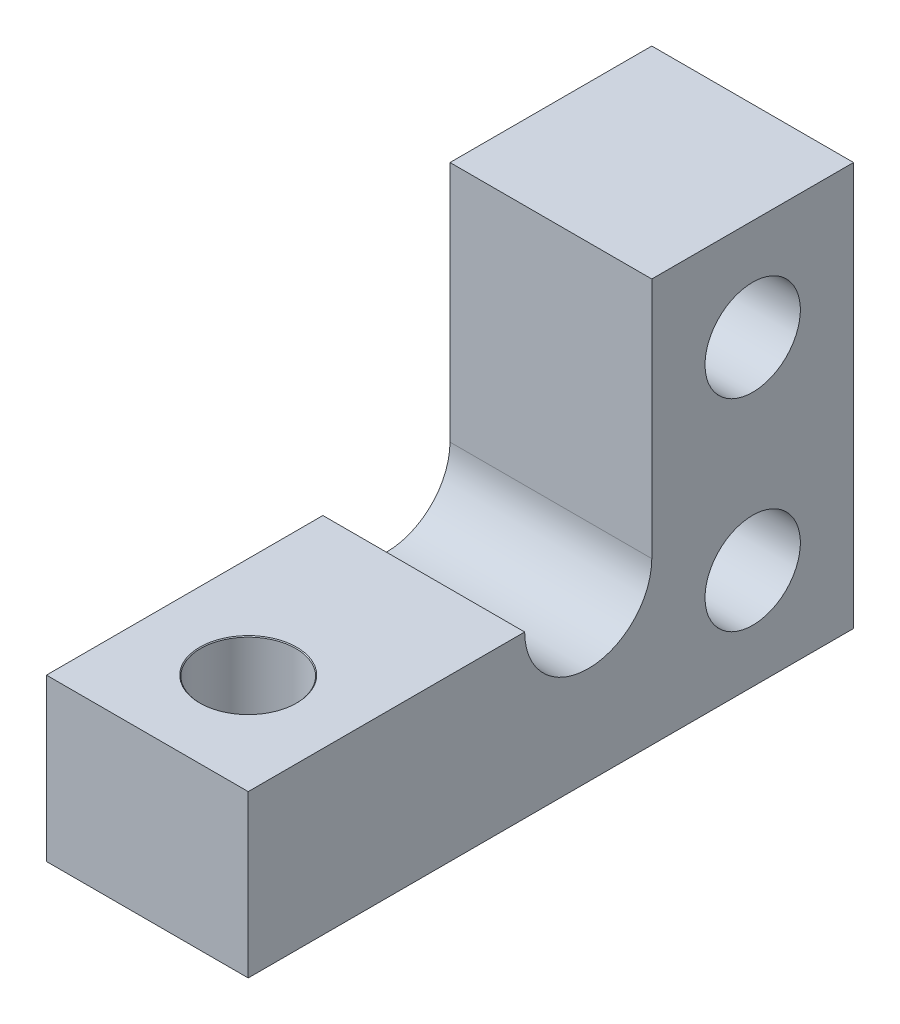
ISO-10303-21;
HEADER;
FILE_DESCRIPTION(('STEP AP214'),'2;1');
FILE_NAME('part.step','',(''),(''),'','','');
FILE_SCHEMA(('AUTOMOTIVE_DESIGN { 1 0 10303 214 1 1 1 1 }'));
ENDSEC;
DATA;
#1=APPLICATION_CONTEXT('core data for automotive mechanical design processes');
#2=APPLICATION_PROTOCOL_DEFINITION('international standard','automotive_design',2000,#1);
#3=PRODUCT_CONTEXT('',#1,'mechanical');
#4=PRODUCT('Part','Part','',(#3));
#5=PRODUCT_RELATED_PRODUCT_CATEGORY('part','',(#4));
#6=PRODUCT_DEFINITION_FORMATION('','',#4);
#7=PRODUCT_DEFINITION_CONTEXT('part definition',#1,'design');
#8=PRODUCT_DEFINITION('design','',#6,#7);
#9=PRODUCT_DEFINITION_SHAPE('','',#8);
#10=(LENGTH_UNIT() NAMED_UNIT(*) SI_UNIT(.MILLI.,.METRE.));
#11=(NAMED_UNIT(*) PLANE_ANGLE_UNIT() SI_UNIT($,.RADIAN.));
#12=(NAMED_UNIT(*) SI_UNIT($,.STERADIAN.) SOLID_ANGLE_UNIT());
#13=UNCERTAINTY_MEASURE_WITH_UNIT(LENGTH_MEASURE(1.E-05),#10,'distance_accuracy_value','');
#14=(GEOMETRIC_REPRESENTATION_CONTEXT(3) GLOBAL_UNCERTAINTY_ASSIGNED_CONTEXT((#13)) GLOBAL_UNIT_ASSIGNED_CONTEXT((#10,
#11,#12)) REPRESENTATION_CONTEXT('',''));
#15=CARTESIAN_POINT('',(0.,0.,0.));
#16=DIRECTION('',(0.,0.,1.));
#17=DIRECTION('',(1.,0.,0.));
#18=AXIS2_PLACEMENT_3D('',#15,#16,#17);
#19=CARTESIAN_POINT('',(6.35,5.08,8.35));
#20=DIRECTION('',(-1.,0.,0.));
#21=DIRECTION('',(0.,0.,1.));
#22=AXIS2_PLACEMENT_3D('',#19,#20,#21);
#23=CYLINDRICAL_SURFACE('',#22,2.);
#24=CARTESIAN_POINT('',(0.,5.08,8.35));
#25=DIRECTION('',(1.,0.,0.));
#26=DIRECTION('',(0.,0.,-1.));
#27=AXIS2_PLACEMENT_3D('',#24,#25,#26);
#28=CIRCLE('',#27,2.);
#29=CARTESIAN_POINT('',(0.,5.08,10.35));
#30=VERTEX_POINT('',#29);
#31=CARTESIAN_POINT('',(0.,5.08,6.35));
#32=VERTEX_POINT('',#31);
#33=EDGE_CURVE('E135',#30,#32,#28,.T.);
#34=ORIENTED_EDGE('',*,*,#33,.F.);
#35=DIRECTION('',(-1.,0.,0.));
#36=VECTOR('',#35,1.);
#37=CARTESIAN_POINT('',(6.35,5.08,10.35));
#38=LINE('',#37,#36);
#39=CARTESIAN_POINT('',(6.35,5.08,10.35));
#40=VERTEX_POINT('',#39);
#41=EDGE_CURVE('E11',#40,#30,#38,.T.);
#42=ORIENTED_EDGE('',*,*,#41,.F.);
#43=CARTESIAN_POINT('',(6.35,5.08,8.35));
#44=DIRECTION('',(1.,0.,0.));
#45=DIRECTION('',(0.,0.,-1.));
#46=AXIS2_PLACEMENT_3D('',#43,#44,#45);
#47=CIRCLE('',#46,2.);
#48=CARTESIAN_POINT('',(6.35,5.08,6.35));
#49=VERTEX_POINT('',#48);
#50=EDGE_CURVE('E160',#40,#49,#47,.T.);
#51=ORIENTED_EDGE('',*,*,#50,.T.);
#52=DIRECTION('',(-1.,0.,0.));
#53=VECTOR('',#52,1.);
#54=CARTESIAN_POINT('',(6.35,5.08,6.35));
#55=LINE('',#54,#53);
#56=EDGE_CURVE('E60',#49,#32,#55,.T.);
#57=ORIENTED_EDGE('',*,*,#56,.T.);
#58=EDGE_LOOP('',(#34,#42,#51,#57));
#59=FACE_BOUND('',#58,.T.);
#60=ADVANCED_FACE('F43',(#59),#23,.F.);
#61=CARTESIAN_POINT('',(6.35,5.08,0.));
#62=DIRECTION('',(0.,1.,0.));
#63=DIRECTION('',(0.,0.,1.));
#64=AXIS2_PLACEMENT_3D('',#61,#62,#63);
#65=PLANE('',#64);
#66=CARTESIAN_POINT('',(3.175,5.08,15.875));
#67=DIRECTION('',(0.,1.,0.));
#68=DIRECTION('',(0.,0.,1.));
#69=AXIS2_PLACEMENT_3D('',#66,#67,#68);
#70=CIRCLE('',#69,1.525);
#71=CARTESIAN_POINT('',(3.175,5.08,17.4));
#72=VERTEX_POINT('',#71);
#73=EDGE_CURVE('E225',#72,#72,#70,.T.);
#74=ORIENTED_EDGE('',*,*,#73,.F.);
#75=EDGE_LOOP('',(#74));
#76=FACE_BOUND('',#75,.T.);
#77=DIRECTION('',(0.,0.,-1.));
#78=VECTOR('',#77,1.);
#79=CARTESIAN_POINT('',(0.,5.08,0.));
#80=LINE('',#79,#78);
#81=CARTESIAN_POINT('',(0.,5.08,19.05));
#82=VERTEX_POINT('',#81);
#83=EDGE_CURVE('E138',#82,#30,#80,.T.);
#84=ORIENTED_EDGE('',*,*,#83,.F.);
#85=DIRECTION('',(-1.,0.,0.));
#86=VECTOR('',#85,1.);
#87=CARTESIAN_POINT('',(6.35,5.08,19.05));
#88=LINE('',#87,#86);
#89=CARTESIAN_POINT('',(6.35,5.08,19.05));
#90=VERTEX_POINT('',#89);
#91=EDGE_CURVE('E52',#90,#82,#88,.T.);
#92=ORIENTED_EDGE('',*,*,#91,.F.);
#93=DIRECTION('',(0.,0.,-1.));
#94=VECTOR('',#93,1.);
#95=CARTESIAN_POINT('',(6.35,5.08,0.));
#96=LINE('',#95,#94);
#97=EDGE_CURVE('E185',#90,#40,#96,.T.);
#98=ORIENTED_EDGE('',*,*,#97,.T.);
#99=ORIENTED_EDGE('',*,*,#41,.T.);
#100=EDGE_LOOP('',(#84,#92,#98,#99));
#101=FACE_BOUND('',#100,.T.);
#102=ADVANCED_FACE('F179',(#76,#101),#65,.T.);
#103=CARTESIAN_POINT('',(6.35,0.,19.05));
#104=DIRECTION('',(0.,0.,1.));
#105=DIRECTION('',(1.,0.,0.));
#106=AXIS2_PLACEMENT_3D('',#103,#104,#105);
#107=PLANE('',#106);
#108=DIRECTION('',(0.,1.,0.));
#109=VECTOR('',#108,1.);
#110=CARTESIAN_POINT('',(0.,0.,19.05));
#111=LINE('',#110,#109);
#112=CARTESIAN_POINT('',(0.,0.,19.05));
#113=VERTEX_POINT('',#112);
#114=EDGE_CURVE('E143',#113,#82,#111,.T.);
#115=ORIENTED_EDGE('',*,*,#114,.F.);
#116=DIRECTION('',(-1.,0.,0.));
#117=VECTOR('',#116,1.);
#118=CARTESIAN_POINT('',(6.35,0.,19.05));
#119=LINE('',#118,#117);
#120=CARTESIAN_POINT('',(6.35,0.,19.05));
#121=VERTEX_POINT('',#120);
#122=EDGE_CURVE('E167',#121,#113,#119,.T.);
#123=ORIENTED_EDGE('',*,*,#122,.F.);
#124=DIRECTION('',(0.,1.,0.));
#125=VECTOR('',#124,1.);
#126=CARTESIAN_POINT('',(6.35,0.,19.05));
#127=LINE('',#126,#125);
#128=EDGE_CURVE('E175',#121,#90,#127,.T.);
#129=ORIENTED_EDGE('',*,*,#128,.T.);
#130=ORIENTED_EDGE('',*,*,#91,.T.);
#131=EDGE_LOOP('',(#115,#123,#129,#130));
#132=FACE_BOUND('',#131,.T.);
#133=ADVANCED_FACE('F174',(#132),#107,.T.);
#134=CARTESIAN_POINT('',(6.35,0.,0.));
#135=DIRECTION('',(0.,-1.,0.));
#136=DIRECTION('',(0.,0.,-1.));
#137=AXIS2_PLACEMENT_3D('',#134,#135,#136);
#138=PLANE('',#137);
#139=CARTESIAN_POINT('',(3.175,0.,15.875));
#140=DIRECTION('',(0.,1.,0.));
#141=DIRECTION('',(0.,0.,1.));
#142=AXIS2_PLACEMENT_3D('',#139,#140,#141);
#143=CIRCLE('',#142,1.5);
#144=CARTESIAN_POINT('',(3.175,0.,17.375));
#145=VERTEX_POINT('',#144);
#146=EDGE_CURVE('E217',#145,#145,#143,.T.);
#147=ORIENTED_EDGE('',*,*,#146,.T.);
#148=EDGE_LOOP('',(#147));
#149=FACE_BOUND('',#148,.T.);
#150=DIRECTION('',(0.,0.,1.));
#151=VECTOR('',#150,1.);
#152=CARTESIAN_POINT('',(0.,0.,0.));
#153=LINE('',#152,#151);
#154=CARTESIAN_POINT('',(0.,0.,0.));
#155=VERTEX_POINT('',#154);
#156=EDGE_CURVE('E147',#155,#113,#153,.T.);
#157=ORIENTED_EDGE('',*,*,#156,.F.);
#158=DIRECTION('',(-1.,0.,0.));
#159=VECTOR('',#158,1.);
#160=CARTESIAN_POINT('',(6.35,0.,0.));
#161=LINE('',#160,#159);
#162=CARTESIAN_POINT('',(6.35,0.,0.));
#163=VERTEX_POINT('',#162);
#164=EDGE_CURVE('E114',#163,#155,#161,.T.);
#165=ORIENTED_EDGE('',*,*,#164,.F.);
#166=DIRECTION('',(0.,0.,1.));
#167=VECTOR('',#166,1.);
#168=CARTESIAN_POINT('',(6.35,0.,0.));
#169=LINE('',#168,#167);
#170=EDGE_CURVE('E124',#163,#121,#169,.T.);
#171=ORIENTED_EDGE('',*,*,#170,.T.);
#172=ORIENTED_EDGE('',*,*,#122,.T.);
#173=EDGE_LOOP('',(#157,#165,#171,#172));
#174=FACE_BOUND('',#173,.T.);
#175=ADVANCED_FACE('F184',(#149,#174),#138,.T.);
#176=CARTESIAN_POINT('',(6.35,0.,0.));
#177=DIRECTION('',(0.,0.,-1.));
#178=DIRECTION('',(0.,1.,0.));
#179=AXIS2_PLACEMENT_3D('',#176,#177,#178);
#180=PLANE('',#179);
#181=DIRECTION('',(0.,-1.,0.));
#182=VECTOR('',#181,1.);
#183=CARTESIAN_POINT('',(0.,0.,0.));
#184=LINE('',#183,#182);
#185=CARTESIAN_POINT('',(0.,12.7,0.));
#186=VERTEX_POINT('',#185);
#187=EDGE_CURVE('E109',#186,#155,#184,.T.);
#188=ORIENTED_EDGE('',*,*,#187,.F.);
#189=DIRECTION('',(-1.,0.,0.));
#190=VECTOR('',#189,1.);
#191=CARTESIAN_POINT('',(6.35,12.7,0.));
#192=LINE('',#191,#190);
#193=CARTESIAN_POINT('',(6.35,12.7,0.));
#194=VERTEX_POINT('',#193);
#195=EDGE_CURVE('E104',#194,#186,#192,.T.);
#196=ORIENTED_EDGE('',*,*,#195,.F.);
#197=DIRECTION('',(0.,-1.,0.));
#198=VECTOR('',#197,1.);
#199=CARTESIAN_POINT('',(6.35,0.,0.));
#200=LINE('',#199,#198);
#201=EDGE_CURVE('E107',#194,#163,#200,.T.);
#202=ORIENTED_EDGE('',*,*,#201,.T.);
#203=ORIENTED_EDGE('',*,*,#164,.T.);
#204=EDGE_LOOP('',(#188,#196,#202,#203));
#205=FACE_BOUND('',#204,.T.);
#206=ADVANCED_FACE('F106',(#205),#180,.T.);
#207=CARTESIAN_POINT('',(6.35,12.7,0.));
#208=DIRECTION('',(0.,1.,0.));
#209=DIRECTION('',(0.,0.,1.));
#210=AXIS2_PLACEMENT_3D('',#207,#208,#209);
#211=PLANE('',#210);
#212=DIRECTION('',(0.,0.,-1.));
#213=VECTOR('',#212,1.);
#214=CARTESIAN_POINT('',(0.,12.7,0.));
#215=LINE('',#214,#213);
#216=CARTESIAN_POINT('',(0.,12.7,6.35));
#217=VERTEX_POINT('',#216);
#218=EDGE_CURVE('E153',#217,#186,#215,.T.);
#219=ORIENTED_EDGE('',*,*,#218,.F.);
#220=DIRECTION('',(-1.,0.,0.));
#221=VECTOR('',#220,1.);
#222=CARTESIAN_POINT('',(6.35,12.7,6.35));
#223=LINE('',#222,#221);
#224=CARTESIAN_POINT('',(6.35,12.7,6.35));
#225=VERTEX_POINT('',#224);
#226=EDGE_CURVE('E82',#225,#217,#223,.T.);
#227=ORIENTED_EDGE('',*,*,#226,.F.);
#228=DIRECTION('',(0.,0.,-1.));
#229=VECTOR('',#228,1.);
#230=CARTESIAN_POINT('',(6.35,12.7,0.));
#231=LINE('',#230,#229);
#232=EDGE_CURVE('E121',#225,#194,#231,.T.);
#233=ORIENTED_EDGE('',*,*,#232,.T.);
#234=ORIENTED_EDGE('',*,*,#195,.T.);
#235=EDGE_LOOP('',(#219,#227,#233,#234));
#236=FACE_BOUND('',#235,.T.);
#237=ADVANCED_FACE('F127',(#236),#211,.T.);
#238=CARTESIAN_POINT('',(6.35,0.,6.35));
#239=DIRECTION('',(0.,0.,1.));
#240=DIRECTION('',(1.,0.,0.));
#241=AXIS2_PLACEMENT_3D('',#238,#239,#240);
#242=PLANE('',#241);
#243=DIRECTION('',(0.,1.,0.));
#244=VECTOR('',#243,1.);
#245=CARTESIAN_POINT('',(0.,0.,6.35));
#246=LINE('',#245,#244);
#247=EDGE_CURVE('E156',#32,#217,#246,.T.);
#248=ORIENTED_EDGE('',*,*,#247,.F.);
#249=ORIENTED_EDGE('',*,*,#56,.F.);
#250=DIRECTION('',(0.,1.,0.));
#251=VECTOR('',#250,1.);
#252=CARTESIAN_POINT('',(6.35,0.,6.35));
#253=LINE('',#252,#251);
#254=EDGE_CURVE('E129',#49,#225,#253,.T.);
#255=ORIENTED_EDGE('',*,*,#254,.T.);
#256=ORIENTED_EDGE('',*,*,#226,.T.);
#257=EDGE_LOOP('',(#248,#249,#255,#256));
#258=FACE_BOUND('',#257,.T.);
#259=ADVANCED_FACE('F246',(#258),#242,.T.);
#260=CARTESIAN_POINT('',(6.35,0.,0.));
#261=DIRECTION('',(1.,0.,0.));
#262=DIRECTION('',(0.,0.,-1.));
#263=AXIS2_PLACEMENT_3D('',#260,#261,#262);
#264=PLANE('',#263);
#265=CARTESIAN_POINT('',(6.34999999999999,3.175,3.175));
#266=DIRECTION('',(-1.,0.,0.));
#267=DIRECTION('',(0.,0.,1.));
#268=AXIS2_PLACEMENT_3D('',#265,#266,#267);
#269=CIRCLE('',#268,1.49999999999999);
#270=CARTESIAN_POINT('',(6.34999999999999,3.175,4.67499999999999));
#271=VERTEX_POINT('',#270);
#272=EDGE_CURVE('E205',#271,#271,#269,.T.);
#273=ORIENTED_EDGE('',*,*,#272,.T.);
#274=EDGE_LOOP('',(#273));
#275=FACE_BOUND('',#274,.T.);
#276=CARTESIAN_POINT('',(6.34999999999999,9.525,3.175));
#277=DIRECTION('',(-1.,0.,0.));
#278=DIRECTION('',(0.,0.,1.));
#279=AXIS2_PLACEMENT_3D('',#276,#277,#278);
#280=CIRCLE('',#279,1.49999999999999);
#281=CARTESIAN_POINT('',(6.34999999999999,9.525,4.67499999999999));
#282=VERTEX_POINT('',#281);
#283=EDGE_CURVE('E139',#282,#282,#280,.T.);
#284=ORIENTED_EDGE('',*,*,#283,.T.);
#285=EDGE_LOOP('',(#284));
#286=FACE_BOUND('',#285,.T.);
#287=ORIENTED_EDGE('',*,*,#50,.F.);
#288=ORIENTED_EDGE('',*,*,#97,.F.);
#289=ORIENTED_EDGE('',*,*,#128,.F.);
#290=ORIENTED_EDGE('',*,*,#170,.F.);
#291=ORIENTED_EDGE('',*,*,#201,.F.);
#292=ORIENTED_EDGE('',*,*,#232,.F.);
#293=ORIENTED_EDGE('',*,*,#254,.F.);
#294=EDGE_LOOP('',(#287,#288,#289,#290,#291,#292,#293));
#295=FACE_BOUND('',#294,.T.);
#296=ADVANCED_FACE('F119',(#275,#286,#295),#264,.T.);
#297=CARTESIAN_POINT('',(0.,0.,0.));
#298=DIRECTION('',(1.,0.,0.));
#299=DIRECTION('',(0.,0.,-1.));
#300=AXIS2_PLACEMENT_3D('',#297,#298,#299);
#301=PLANE('',#300);
#302=CARTESIAN_POINT('',(0.,3.175,3.175));
#303=DIRECTION('',(-1.,0.,0.));
#304=DIRECTION('',(0.,0.,1.));
#305=AXIS2_PLACEMENT_3D('',#302,#303,#304);
#306=CIRCLE('',#305,1.525);
#307=CARTESIAN_POINT('',(0.,3.175,4.7));
#308=VERTEX_POINT('',#307);
#309=EDGE_CURVE('E213',#308,#308,#306,.T.);
#310=ORIENTED_EDGE('',*,*,#309,.F.);
#311=EDGE_LOOP('',(#310));
#312=FACE_BOUND('',#311,.T.);
#313=CARTESIAN_POINT('',(0.,9.525,3.175));
#314=DIRECTION('',(-1.,0.,0.));
#315=DIRECTION('',(0.,0.,1.));
#316=AXIS2_PLACEMENT_3D('',#313,#314,#315);
#317=CIRCLE('',#316,1.525);
#318=CARTESIAN_POINT('',(0.,9.525,4.7));
#319=VERTEX_POINT('',#318);
#320=EDGE_CURVE('E201',#319,#319,#317,.T.);
#321=ORIENTED_EDGE('',*,*,#320,.F.);
#322=EDGE_LOOP('',(#321));
#323=FACE_BOUND('',#322,.T.);
#324=ORIENTED_EDGE('',*,*,#33,.T.);
#325=ORIENTED_EDGE('',*,*,#247,.T.);
#326=ORIENTED_EDGE('',*,*,#218,.T.);
#327=ORIENTED_EDGE('',*,*,#187,.T.);
#328=ORIENTED_EDGE('',*,*,#156,.T.);
#329=ORIENTED_EDGE('',*,*,#114,.T.);
#330=ORIENTED_EDGE('',*,*,#83,.T.);
#331=EDGE_LOOP('',(#324,#325,#326,#327,#328,#329,#330));
#332=FACE_BOUND('',#331,.T.);
#333=ADVANCED_FACE('F181',(#312,#323,#332),#301,.F.);
#334=CARTESIAN_POINT('',(0.,9.525,3.175));
#335=DIRECTION('',(-1.,0.,0.));
#336=DIRECTION('',(0.,0.,1.));
#337=AXIS2_PLACEMENT_3D('',#334,#335,#336);
#338=CYLINDRICAL_SURFACE('',#337,1.49999999999999);
#339=ORIENTED_EDGE('',*,*,#283,.F.);
#340=EDGE_LOOP('',(#339));
#341=FACE_BOUND('',#340,.T.);
#342=CARTESIAN_POINT('',(0.0249999999999972,9.525,3.175));
#343=DIRECTION('',(-1.,0.,0.));
#344=DIRECTION('',(0.,0.,1.));
#345=AXIS2_PLACEMENT_3D('',#342,#343,#344);
#346=CIRCLE('',#345,1.49999999999999);
#347=CARTESIAN_POINT('',(0.0249999999999972,9.525,4.67499999999999));
#348=VERTEX_POINT('',#347);
#349=EDGE_CURVE('E197',#348,#348,#346,.T.);
#350=ORIENTED_EDGE('',*,*,#349,.T.);
#351=EDGE_LOOP('',(#350));
#352=FACE_BOUND('',#351,.T.);
#353=ADVANCED_FACE('F251',(#341,#352),#338,.F.);
#354=CARTESIAN_POINT('',(0.,9.525,3.175));
#355=DIRECTION('',(-1.,0.,0.));
#356=DIRECTION('',(0.,0.,1.));
#357=AXIS2_PLACEMENT_3D('',#354,#355,#356);
#358=CONICAL_SURFACE('',#357,1.525,0.785398163397726);
#359=ORIENTED_EDGE('',*,*,#349,.F.);
#360=EDGE_LOOP('',(#359));
#361=FACE_BOUND('',#360,.T.);
#362=ORIENTED_EDGE('',*,*,#320,.T.);
#363=EDGE_LOOP('',(#362));
#364=FACE_BOUND('',#363,.T.);
#365=ADVANCED_FACE('F258',(#361,#364),#358,.F.);
#366=CARTESIAN_POINT('',(0.,3.175,3.175));
#367=DIRECTION('',(-1.,0.,0.));
#368=DIRECTION('',(0.,0.,1.));
#369=AXIS2_PLACEMENT_3D('',#366,#367,#368);
#370=CYLINDRICAL_SURFACE('',#369,1.49999999999999);
#371=ORIENTED_EDGE('',*,*,#272,.F.);
#372=EDGE_LOOP('',(#371));
#373=FACE_BOUND('',#372,.T.);
#374=CARTESIAN_POINT('',(0.0249999999999972,3.175,3.175));
#375=DIRECTION('',(-1.,0.,0.));
#376=DIRECTION('',(0.,0.,1.));
#377=AXIS2_PLACEMENT_3D('',#374,#375,#376);
#378=CIRCLE('',#377,1.49999999999999);
#379=CARTESIAN_POINT('',(0.0249999999999972,3.175,4.67499999999999));
#380=VERTEX_POINT('',#379);
#381=EDGE_CURVE('E209',#380,#380,#378,.T.);
#382=ORIENTED_EDGE('',*,*,#381,.T.);
#383=EDGE_LOOP('',(#382));
#384=FACE_BOUND('',#383,.T.);
#385=ADVANCED_FACE('F262',(#373,#384),#370,.F.);
#386=CARTESIAN_POINT('',(0.,3.175,3.175));
#387=DIRECTION('',(-1.,0.,0.));
#388=DIRECTION('',(0.,0.,1.));
#389=AXIS2_PLACEMENT_3D('',#386,#387,#388);
#390=CONICAL_SURFACE('',#389,1.525,0.785398163397726);
#391=ORIENTED_EDGE('',*,*,#381,.F.);
#392=EDGE_LOOP('',(#391));
#393=FACE_BOUND('',#392,.T.);
#394=ORIENTED_EDGE('',*,*,#309,.T.);
#395=EDGE_LOOP('',(#394));
#396=FACE_BOUND('',#395,.T.);
#397=ADVANCED_FACE('F266',(#393,#396),#390,.F.);
#398=CARTESIAN_POINT('',(3.175,5.08,15.875));
#399=DIRECTION('',(0.,1.,0.));
#400=DIRECTION('',(0.,0.,1.));
#401=AXIS2_PLACEMENT_3D('',#398,#399,#400);
#402=CYLINDRICAL_SURFACE('',#401,1.49999999999999);
#403=ORIENTED_EDGE('',*,*,#146,.F.);
#404=EDGE_LOOP('',(#403));
#405=FACE_BOUND('',#404,.T.);
#406=CARTESIAN_POINT('',(3.175,5.055,15.875));
#407=DIRECTION('',(0.,1.,0.));
#408=DIRECTION('',(0.,0.,1.));
#409=AXIS2_PLACEMENT_3D('',#406,#407,#408);
#410=CIRCLE('',#409,1.49999999999999);
#411=CARTESIAN_POINT('',(3.175,5.055,17.375));
#412=VERTEX_POINT('',#411);
#413=EDGE_CURVE('E221',#412,#412,#410,.T.);
#414=ORIENTED_EDGE('',*,*,#413,.T.);
#415=EDGE_LOOP('',(#414));
#416=FACE_BOUND('',#415,.T.);
#417=ADVANCED_FACE('F270',(#405,#416),#402,.F.);
#418=CARTESIAN_POINT('',(3.175,5.08,15.875));
#419=DIRECTION('',(0.,1.,0.));
#420=DIRECTION('',(0.,0.,1.));
#421=AXIS2_PLACEMENT_3D('',#418,#419,#420);
#422=CONICAL_SURFACE('',#421,1.525,0.785398163397726);
#423=ORIENTED_EDGE('',*,*,#413,.F.);
#424=EDGE_LOOP('',(#423));
#425=FACE_BOUND('',#424,.T.);
#426=ORIENTED_EDGE('',*,*,#73,.T.);
#427=EDGE_LOOP('',(#426));
#428=FACE_BOUND('',#427,.T.);
#429=ADVANCED_FACE('F230',(#425,#428),#422,.F.);
#430=CLOSED_SHELL('',(#60,#102,#133,#175,#206,#237,#259,#296,#333,#353,#365,#385,#397,#417,#429));
#431=MANIFOLD_SOLID_BREP('B2',#430);
#432=ADVANCED_BREP_SHAPE_REPRESENTATION('',(#18,#431),#14);
#433=SHAPE_DEFINITION_REPRESENTATION(#9,#432);
ENDSEC;
END-ISO-10303-21;
